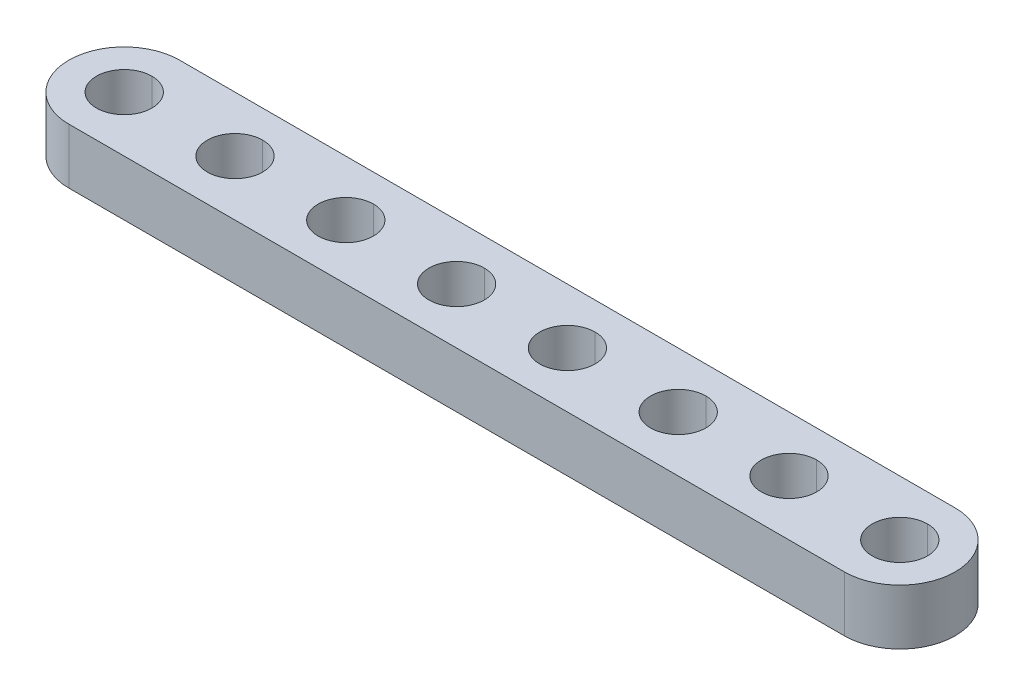
ISO-10303-21;
HEADER;
FILE_DESCRIPTION(('STEP AP214'),'2;1');
FILE_NAME('part.step','',(''),(''),'','','');
FILE_SCHEMA(('AUTOMOTIVE_DESIGN { 1 0 10303 214 1 1 1 1 }'));
ENDSEC;
DATA;
#1=APPLICATION_CONTEXT('core data for automotive mechanical design processes');
#2=APPLICATION_PROTOCOL_DEFINITION('international standard','automotive_design',2000,#1);
#3=PRODUCT_CONTEXT('',#1,'mechanical');
#4=PRODUCT('Part','Part','',(#3));
#5=PRODUCT_RELATED_PRODUCT_CATEGORY('part','',(#4));
#6=PRODUCT_DEFINITION_FORMATION('','',#4);
#7=PRODUCT_DEFINITION_CONTEXT('part definition',#1,'design');
#8=PRODUCT_DEFINITION('design','',#6,#7);
#9=PRODUCT_DEFINITION_SHAPE('','',#8);
#10=(LENGTH_UNIT() NAMED_UNIT(*) SI_UNIT(.MILLI.,.METRE.));
#11=(NAMED_UNIT(*) PLANE_ANGLE_UNIT() SI_UNIT($,.RADIAN.));
#12=(NAMED_UNIT(*) SI_UNIT($,.STERADIAN.) SOLID_ANGLE_UNIT());
#13=UNCERTAINTY_MEASURE_WITH_UNIT(LENGTH_MEASURE(1.E-05),#10,'distance_accuracy_value','');
#14=(GEOMETRIC_REPRESENTATION_CONTEXT(3) GLOBAL_UNCERTAINTY_ASSIGNED_CONTEXT((#13)) GLOBAL_UNIT_ASSIGNED_CONTEXT((#10,
#11,#12)) REPRESENTATION_CONTEXT('',''));
#15=CARTESIAN_POINT('',(0.,0.,0.));
#16=DIRECTION('',(0.,0.,1.));
#17=DIRECTION('',(1.,0.,0.));
#18=AXIS2_PLACEMENT_3D('',#15,#16,#17);
#19=CARTESIAN_POINT('',(28.,4.,0.));
#20=DIRECTION('',(0.,1.,0.));
#21=DIRECTION('',(0.,0.,1.));
#22=AXIS2_PLACEMENT_3D('',#19,#20,#21);
#23=CYLINDRICAL_SURFACE('',#22,2.);
#24=DIRECTION('',(0.,1.,0.));
#25=VECTOR('',#24,1.);
#26=CARTESIAN_POINT('',(28.,4.,-2.));
#27=LINE('',#26,#25);
#28=CARTESIAN_POINT('',(28.,0.,-2.));
#29=VERTEX_POINT('',#28);
#30=CARTESIAN_POINT('',(28.,4.,-2.));
#31=VERTEX_POINT('',#30);
#32=EDGE_CURVE('E224',#29,#31,#27,.T.);
#33=ORIENTED_EDGE('',*,*,#32,.F.);
#34=CARTESIAN_POINT('',(28.,0.,0.));
#35=DIRECTION('',(0.,1.,0.));
#36=DIRECTION('',(0.,0.,1.));
#37=AXIS2_PLACEMENT_3D('',#34,#35,#36);
#38=CIRCLE('',#37,2.);
#39=CARTESIAN_POINT('',(28.,0.,2.));
#40=VERTEX_POINT('',#39);
#41=EDGE_CURVE('E197',#40,#29,#38,.T.);
#42=ORIENTED_EDGE('',*,*,#41,.F.);
#43=DIRECTION('',(0.,1.,0.));
#44=VECTOR('',#43,1.);
#45=CARTESIAN_POINT('',(28.,4.,2.));
#46=LINE('',#45,#44);
#47=CARTESIAN_POINT('',(28.,4.,2.));
#48=VERTEX_POINT('',#47);
#49=EDGE_CURVE('E210',#40,#48,#46,.T.);
#50=ORIENTED_EDGE('',*,*,#49,.T.);
#51=CARTESIAN_POINT('',(28.,4.,0.));
#52=DIRECTION('',(0.,1.,0.));
#53=DIRECTION('',(0.,0.,1.));
#54=AXIS2_PLACEMENT_3D('',#51,#52,#53);
#55=CIRCLE('',#54,2.);
#56=EDGE_CURVE('E305',#48,#31,#55,.T.);
#57=ORIENTED_EDGE('',*,*,#56,.T.);
#58=EDGE_LOOP('',(#33,#42,#50,#57));
#59=FACE_BOUND('',#58,.T.);
#60=ADVANCED_FACE('F14',(#59),#23,.F.);
#61=CARTESIAN_POINT('',(20.,4.,0.));
#62=DIRECTION('',(0.,1.,0.));
#63=DIRECTION('',(0.,0.,1.));
#64=AXIS2_PLACEMENT_3D('',#61,#62,#63);
#65=CYLINDRICAL_SURFACE('',#64,2.);
#66=DIRECTION('',(0.,1.,0.));
#67=VECTOR('',#66,1.);
#68=CARTESIAN_POINT('',(20.,4.,-2.));
#69=LINE('',#68,#67);
#70=CARTESIAN_POINT('',(20.,0.,-2.));
#71=VERTEX_POINT('',#70);
#72=CARTESIAN_POINT('',(20.,4.,-2.));
#73=VERTEX_POINT('',#72);
#74=EDGE_CURVE('E191',#71,#73,#69,.T.);
#75=ORIENTED_EDGE('',*,*,#74,.F.);
#76=CARTESIAN_POINT('',(20.,0.,0.));
#77=DIRECTION('',(0.,1.,0.));
#78=DIRECTION('',(0.,0.,1.));
#79=AXIS2_PLACEMENT_3D('',#76,#77,#78);
#80=CIRCLE('',#79,2.);
#81=CARTESIAN_POINT('',(20.,0.,2.));
#82=VERTEX_POINT('',#81);
#83=EDGE_CURVE('E185',#82,#71,#80,.T.);
#84=ORIENTED_EDGE('',*,*,#83,.F.);
#85=DIRECTION('',(0.,1.,0.));
#86=VECTOR('',#85,1.);
#87=CARTESIAN_POINT('',(20.,4.,2.));
#88=LINE('',#87,#86);
#89=CARTESIAN_POINT('',(20.,4.,2.));
#90=VERTEX_POINT('',#89);
#91=EDGE_CURVE('E188',#82,#90,#88,.T.);
#92=ORIENTED_EDGE('',*,*,#91,.T.);
#93=CARTESIAN_POINT('',(20.,4.,0.));
#94=DIRECTION('',(0.,1.,0.));
#95=DIRECTION('',(0.,0.,1.));
#96=AXIS2_PLACEMENT_3D('',#93,#94,#95);
#97=CIRCLE('',#96,2.);
#98=EDGE_CURVE('E382',#90,#73,#97,.T.);
#99=ORIENTED_EDGE('',*,*,#98,.T.);
#100=EDGE_LOOP('',(#75,#84,#92,#99));
#101=FACE_BOUND('',#100,.T.);
#102=ADVANCED_FACE('F187',(#101),#65,.F.);
#103=CARTESIAN_POINT('',(12.,4.,0.));
#104=DIRECTION('',(0.,1.,0.));
#105=DIRECTION('',(0.,0.,1.));
#106=AXIS2_PLACEMENT_3D('',#103,#104,#105);
#107=CYLINDRICAL_SURFACE('',#106,2.);
#108=DIRECTION('',(0.,1.,0.));
#109=VECTOR('',#108,1.);
#110=CARTESIAN_POINT('',(12.,4.,-2.));
#111=LINE('',#110,#109);
#112=CARTESIAN_POINT('',(12.,0.,-2.));
#113=VERTEX_POINT('',#112);
#114=CARTESIAN_POINT('',(12.,4.,-2.));
#115=VERTEX_POINT('',#114);
#116=EDGE_CURVE('E379',#113,#115,#111,.T.);
#117=ORIENTED_EDGE('',*,*,#116,.F.);
#118=CARTESIAN_POINT('',(12.,0.,0.));
#119=DIRECTION('',(0.,1.,0.));
#120=DIRECTION('',(0.,0.,1.));
#121=AXIS2_PLACEMENT_3D('',#118,#119,#120);
#122=CIRCLE('',#121,2.);
#123=CARTESIAN_POINT('',(12.,0.,2.));
#124=VERTEX_POINT('',#123);
#125=EDGE_CURVE('E196',#124,#113,#122,.T.);
#126=ORIENTED_EDGE('',*,*,#125,.F.);
#127=DIRECTION('',(0.,1.,0.));
#128=VECTOR('',#127,1.);
#129=CARTESIAN_POINT('',(12.,4.,2.));
#130=LINE('',#129,#128);
#131=CARTESIAN_POINT('',(12.,4.,2.));
#132=VERTEX_POINT('',#131);
#133=EDGE_CURVE('E236',#124,#132,#130,.T.);
#134=ORIENTED_EDGE('',*,*,#133,.T.);
#135=CARTESIAN_POINT('',(12.,4.,0.));
#136=DIRECTION('',(0.,1.,0.));
#137=DIRECTION('',(0.,0.,1.));
#138=AXIS2_PLACEMENT_3D('',#135,#136,#137);
#139=CIRCLE('',#138,2.);
#140=EDGE_CURVE('E380',#132,#115,#139,.T.);
#141=ORIENTED_EDGE('',*,*,#140,.T.);
#142=EDGE_LOOP('',(#117,#126,#134,#141));
#143=FACE_BOUND('',#142,.T.);
#144=ADVANCED_FACE('F480',(#143),#107,.F.);
#145=CARTESIAN_POINT('',(4.,4.,0.));
#146=DIRECTION('',(0.,1.,0.));
#147=DIRECTION('',(0.,0.,1.));
#148=AXIS2_PLACEMENT_3D('',#145,#146,#147);
#149=CYLINDRICAL_SURFACE('',#148,2.);
#150=DIRECTION('',(0.,1.,0.));
#151=VECTOR('',#150,1.);
#152=CARTESIAN_POINT('',(4.,4.,-2.));
#153=LINE('',#152,#151);
#154=CARTESIAN_POINT('',(4.,0.,-2.));
#155=VERTEX_POINT('',#154);
#156=CARTESIAN_POINT('',(4.,4.,-2.));
#157=VERTEX_POINT('',#156);
#158=EDGE_CURVE('E235',#155,#157,#153,.T.);
#159=ORIENTED_EDGE('',*,*,#158,.F.);
#160=CARTESIAN_POINT('',(4.,0.,0.));
#161=DIRECTION('',(0.,1.,0.));
#162=DIRECTION('',(0.,0.,1.));
#163=AXIS2_PLACEMENT_3D('',#160,#161,#162);
#164=CIRCLE('',#163,2.);
#165=CARTESIAN_POINT('',(4.,0.,2.));
#166=VERTEX_POINT('',#165);
#167=EDGE_CURVE('E290',#166,#155,#164,.T.);
#168=ORIENTED_EDGE('',*,*,#167,.F.);
#169=DIRECTION('',(0.,1.,0.));
#170=VECTOR('',#169,1.);
#171=CARTESIAN_POINT('',(4.,4.,2.));
#172=LINE('',#171,#170);
#173=CARTESIAN_POINT('',(4.,4.,2.));
#174=VERTEX_POINT('',#173);
#175=EDGE_CURVE('E384',#166,#174,#172,.T.);
#176=ORIENTED_EDGE('',*,*,#175,.T.);
#177=CARTESIAN_POINT('',(4.,4.,0.));
#178=DIRECTION('',(0.,1.,0.));
#179=DIRECTION('',(0.,0.,1.));
#180=AXIS2_PLACEMENT_3D('',#177,#178,#179);
#181=CIRCLE('',#180,2.);
#182=EDGE_CURVE('E261',#174,#157,#181,.T.);
#183=ORIENTED_EDGE('',*,*,#182,.T.);
#184=EDGE_LOOP('',(#159,#168,#176,#183));
#185=FACE_BOUND('',#184,.T.);
#186=ADVANCED_FACE('F518',(#185),#149,.F.);
#187=CARTESIAN_POINT('',(-4.,4.,0.));
#188=DIRECTION('',(0.,1.,0.));
#189=DIRECTION('',(0.,0.,1.));
#190=AXIS2_PLACEMENT_3D('',#187,#188,#189);
#191=CYLINDRICAL_SURFACE('',#190,2.);
#192=DIRECTION('',(0.,1.,0.));
#193=VECTOR('',#192,1.);
#194=CARTESIAN_POINT('',(-4.,4.,-2.));
#195=LINE('',#194,#193);
#196=CARTESIAN_POINT('',(-4.,0.,-2.));
#197=VERTEX_POINT('',#196);
#198=CARTESIAN_POINT('',(-4.,4.,-2.));
#199=VERTEX_POINT('',#198);
#200=EDGE_CURVE('E279',#197,#199,#195,.T.);
#201=ORIENTED_EDGE('',*,*,#200,.F.);
#202=CARTESIAN_POINT('',(-4.,0.,0.));
#203=DIRECTION('',(0.,1.,0.));
#204=DIRECTION('',(0.,0.,1.));
#205=AXIS2_PLACEMENT_3D('',#202,#203,#204);
#206=CIRCLE('',#205,2.);
#207=CARTESIAN_POINT('',(-4.,0.,2.));
#208=VERTEX_POINT('',#207);
#209=EDGE_CURVE('E350',#208,#197,#206,.T.);
#210=ORIENTED_EDGE('',*,*,#209,.F.);
#211=DIRECTION('',(0.,1.,0.));
#212=VECTOR('',#211,1.);
#213=CARTESIAN_POINT('',(-4.,4.,2.));
#214=LINE('',#213,#212);
#215=CARTESIAN_POINT('',(-4.,4.,2.));
#216=VERTEX_POINT('',#215);
#217=EDGE_CURVE('E245',#208,#216,#214,.T.);
#218=ORIENTED_EDGE('',*,*,#217,.T.);
#219=CARTESIAN_POINT('',(-4.,4.,0.));
#220=DIRECTION('',(0.,1.,0.));
#221=DIRECTION('',(0.,0.,1.));
#222=AXIS2_PLACEMENT_3D('',#219,#220,#221);
#223=CIRCLE('',#222,2.);
#224=EDGE_CURVE('E258',#216,#199,#223,.T.);
#225=ORIENTED_EDGE('',*,*,#224,.T.);
#226=EDGE_LOOP('',(#201,#210,#218,#225));
#227=FACE_BOUND('',#226,.T.);
#228=ADVANCED_FACE('F516',(#227),#191,.F.);
#229=CARTESIAN_POINT('',(-12.,4.,0.));
#230=DIRECTION('',(0.,1.,0.));
#231=DIRECTION('',(0.,0.,1.));
#232=AXIS2_PLACEMENT_3D('',#229,#230,#231);
#233=CYLINDRICAL_SURFACE('',#232,2.);
#234=DIRECTION('',(0.,1.,0.));
#235=VECTOR('',#234,1.);
#236=CARTESIAN_POINT('',(-12.,4.,-2.));
#237=LINE('',#236,#235);
#238=CARTESIAN_POINT('',(-12.,0.,-2.));
#239=VERTEX_POINT('',#238);
#240=CARTESIAN_POINT('',(-12.,4.,-2.));
#241=VERTEX_POINT('',#240);
#242=EDGE_CURVE('E244',#239,#241,#237,.T.);
#243=ORIENTED_EDGE('',*,*,#242,.F.);
#244=CARTESIAN_POINT('',(-12.,0.,0.));
#245=DIRECTION('',(0.,1.,0.));
#246=DIRECTION('',(0.,0.,1.));
#247=AXIS2_PLACEMENT_3D('',#244,#245,#246);
#248=CIRCLE('',#247,2.);
#249=CARTESIAN_POINT('',(-12.,0.,2.));
#250=VERTEX_POINT('',#249);
#251=EDGE_CURVE('E239',#250,#239,#248,.T.);
#252=ORIENTED_EDGE('',*,*,#251,.F.);
#253=DIRECTION('',(0.,1.,0.));
#254=VECTOR('',#253,1.);
#255=CARTESIAN_POINT('',(-12.,4.,2.));
#256=LINE('',#255,#254);
#257=CARTESIAN_POINT('',(-12.,4.,2.));
#258=VERTEX_POINT('',#257);
#259=EDGE_CURVE('E263',#250,#258,#256,.T.);
#260=ORIENTED_EDGE('',*,*,#259,.T.);
#261=CARTESIAN_POINT('',(-12.,4.,0.));
#262=DIRECTION('',(0.,1.,0.));
#263=DIRECTION('',(0.,0.,1.));
#264=AXIS2_PLACEMENT_3D('',#261,#262,#263);
#265=CIRCLE('',#264,2.);
#266=EDGE_CURVE('E260',#258,#241,#265,.T.);
#267=ORIENTED_EDGE('',*,*,#266,.T.);
#268=EDGE_LOOP('',(#243,#252,#260,#267));
#269=FACE_BOUND('',#268,.T.);
#270=ADVANCED_FACE('F515',(#269),#233,.F.);
#271=CARTESIAN_POINT('',(-20.,4.,0.));
#272=DIRECTION('',(0.,1.,0.));
#273=DIRECTION('',(0.,0.,1.));
#274=AXIS2_PLACEMENT_3D('',#271,#272,#273);
#275=CYLINDRICAL_SURFACE('',#274,2.);
#276=DIRECTION('',(0.,1.,0.));
#277=VECTOR('',#276,1.);
#278=CARTESIAN_POINT('',(-20.,4.,-2.));
#279=LINE('',#278,#277);
#280=CARTESIAN_POINT('',(-20.,0.,-2.));
#281=VERTEX_POINT('',#280);
#282=CARTESIAN_POINT('',(-20.,4.,-2.));
#283=VERTEX_POINT('',#282);
#284=EDGE_CURVE('E226',#281,#283,#279,.T.);
#285=ORIENTED_EDGE('',*,*,#284,.F.);
#286=CARTESIAN_POINT('',(-20.,0.,0.));
#287=DIRECTION('',(0.,1.,0.));
#288=DIRECTION('',(0.,0.,1.));
#289=AXIS2_PLACEMENT_3D('',#286,#287,#288);
#290=CIRCLE('',#289,2.);
#291=CARTESIAN_POINT('',(-20.,0.,2.));
#292=VERTEX_POINT('',#291);
#293=EDGE_CURVE('E25',#292,#281,#290,.T.);
#294=ORIENTED_EDGE('',*,*,#293,.F.);
#295=DIRECTION('',(0.,1.,0.));
#296=VECTOR('',#295,1.);
#297=CARTESIAN_POINT('',(-20.,4.,2.));
#298=LINE('',#297,#296);
#299=CARTESIAN_POINT('',(-20.,4.,2.));
#300=VERTEX_POINT('',#299);
#301=EDGE_CURVE('E294',#292,#300,#298,.T.);
#302=ORIENTED_EDGE('',*,*,#301,.T.);
#303=CARTESIAN_POINT('',(-20.,4.,0.));
#304=DIRECTION('',(0.,1.,0.));
#305=DIRECTION('',(0.,0.,1.));
#306=AXIS2_PLACEMENT_3D('',#303,#304,#305);
#307=CIRCLE('',#306,2.);
#308=EDGE_CURVE('E298',#300,#283,#307,.T.);
#309=ORIENTED_EDGE('',*,*,#308,.T.);
#310=EDGE_LOOP('',(#285,#294,#302,#309));
#311=FACE_BOUND('',#310,.T.);
#312=ADVANCED_FACE('F462',(#311),#275,.F.);
#313=CARTESIAN_POINT('',(-28.,4.,0.));
#314=DIRECTION('',(0.,1.,0.));
#315=DIRECTION('',(0.,0.,1.));
#316=AXIS2_PLACEMENT_3D('',#313,#314,#315);
#317=CYLINDRICAL_SURFACE('',#316,2.);
#318=DIRECTION('',(0.,1.,0.));
#319=VECTOR('',#318,1.);
#320=CARTESIAN_POINT('',(-28.,4.,-2.));
#321=LINE('',#320,#319);
#322=CARTESIAN_POINT('',(-28.,0.,-2.));
#323=VERTEX_POINT('',#322);
#324=CARTESIAN_POINT('',(-28.,4.,-2.));
#325=VERTEX_POINT('',#324);
#326=EDGE_CURVE('E246',#323,#325,#321,.T.);
#327=ORIENTED_EDGE('',*,*,#326,.F.);
#328=CARTESIAN_POINT('',(-28.,0.,0.));
#329=DIRECTION('',(0.,1.,0.));
#330=DIRECTION('',(0.,0.,1.));
#331=AXIS2_PLACEMENT_3D('',#328,#329,#330);
#332=CIRCLE('',#331,2.);
#333=CARTESIAN_POINT('',(-28.,0.,2.));
#334=VERTEX_POINT('',#333);
#335=EDGE_CURVE('E9',#334,#323,#332,.T.);
#336=ORIENTED_EDGE('',*,*,#335,.F.);
#337=DIRECTION('',(0.,1.,0.));
#338=VECTOR('',#337,1.);
#339=CARTESIAN_POINT('',(-28.,4.,2.));
#340=LINE('',#339,#338);
#341=CARTESIAN_POINT('',(-28.,4.,2.));
#342=VERTEX_POINT('',#341);
#343=EDGE_CURVE('E301',#334,#342,#340,.T.);
#344=ORIENTED_EDGE('',*,*,#343,.T.);
#345=CARTESIAN_POINT('',(-28.,4.,0.));
#346=DIRECTION('',(0.,1.,0.));
#347=DIRECTION('',(0.,0.,1.));
#348=AXIS2_PLACEMENT_3D('',#345,#346,#347);
#349=CIRCLE('',#348,2.);
#350=EDGE_CURVE('E295',#342,#325,#349,.T.);
#351=ORIENTED_EDGE('',*,*,#350,.T.);
#352=EDGE_LOOP('',(#327,#336,#344,#351));
#353=FACE_BOUND('',#352,.T.);
#354=ADVANCED_FACE('F470',(#353),#317,.F.);
#355=CARTESIAN_POINT('',(-28.,0.,0.));
#356=DIRECTION('',(0.,1.,0.));
#357=DIRECTION('',(1.,0.,0.));
#358=AXIS2_PLACEMENT_3D('',#355,#356,#357);
#359=PLANE('',#358);
#360=ORIENTED_EDGE('',*,*,#335,.T.);
#361=CARTESIAN_POINT('',(-28.,0.,0.));
#362=DIRECTION('',(0.,1.,0.));
#363=DIRECTION('',(0.,0.,1.));
#364=AXIS2_PLACEMENT_3D('',#361,#362,#363);
#365=CIRCLE('',#364,2.);
#366=EDGE_CURVE('E251',#323,#334,#365,.T.);
#367=ORIENTED_EDGE('',*,*,#366,.T.);
#368=EDGE_LOOP('',(#360,#367));
#369=FACE_BOUND('',#368,.T.);
#370=ORIENTED_EDGE('',*,*,#293,.T.);
#371=CARTESIAN_POINT('',(-20.,0.,0.));
#372=DIRECTION('',(0.,1.,0.));
#373=DIRECTION('',(0.,0.,1.));
#374=AXIS2_PLACEMENT_3D('',#371,#372,#373);
#375=CIRCLE('',#374,2.);
#376=EDGE_CURVE('E230',#281,#292,#375,.T.);
#377=ORIENTED_EDGE('',*,*,#376,.T.);
#378=EDGE_LOOP('',(#370,#377));
#379=FACE_BOUND('',#378,.T.);
#380=ORIENTED_EDGE('',*,*,#251,.T.);
#381=CARTESIAN_POINT('',(-12.,0.,0.));
#382=DIRECTION('',(0.,1.,0.));
#383=DIRECTION('',(0.,0.,1.));
#384=AXIS2_PLACEMENT_3D('',#381,#382,#383);
#385=CIRCLE('',#384,2.);
#386=EDGE_CURVE('E240',#239,#250,#385,.T.);
#387=ORIENTED_EDGE('',*,*,#386,.T.);
#388=EDGE_LOOP('',(#380,#387));
#389=FACE_BOUND('',#388,.T.);
#390=ORIENTED_EDGE('',*,*,#209,.T.);
#391=CARTESIAN_POINT('',(-4.,0.,0.));
#392=DIRECTION('',(0.,1.,0.));
#393=DIRECTION('',(0.,0.,1.));
#394=AXIS2_PLACEMENT_3D('',#391,#392,#393);
#395=CIRCLE('',#394,2.);
#396=EDGE_CURVE('E388',#197,#208,#395,.T.);
#397=ORIENTED_EDGE('',*,*,#396,.T.);
#398=EDGE_LOOP('',(#390,#397));
#399=FACE_BOUND('',#398,.T.);
#400=ORIENTED_EDGE('',*,*,#167,.T.);
#401=CARTESIAN_POINT('',(4.,0.,0.));
#402=DIRECTION('',(0.,1.,0.));
#403=DIRECTION('',(0.,0.,1.));
#404=AXIS2_PLACEMENT_3D('',#401,#402,#403);
#405=CIRCLE('',#404,2.);
#406=EDGE_CURVE('E231',#155,#166,#405,.T.);
#407=ORIENTED_EDGE('',*,*,#406,.T.);
#408=EDGE_LOOP('',(#400,#407));
#409=FACE_BOUND('',#408,.T.);
#410=ORIENTED_EDGE('',*,*,#125,.T.);
#411=CARTESIAN_POINT('',(12.,0.,0.));
#412=DIRECTION('',(0.,1.,0.));
#413=DIRECTION('',(0.,0.,1.));
#414=AXIS2_PLACEMENT_3D('',#411,#412,#413);
#415=CIRCLE('',#414,2.);
#416=EDGE_CURVE('E205',#113,#124,#415,.T.);
#417=ORIENTED_EDGE('',*,*,#416,.T.);
#418=EDGE_LOOP('',(#410,#417));
#419=FACE_BOUND('',#418,.T.);
#420=ORIENTED_EDGE('',*,*,#83,.T.);
#421=CARTESIAN_POINT('',(20.,0.,0.));
#422=DIRECTION('',(0.,1.,0.));
#423=DIRECTION('',(0.,0.,1.));
#424=AXIS2_PLACEMENT_3D('',#421,#422,#423);
#425=CIRCLE('',#424,2.);
#426=EDGE_CURVE('E201',#71,#82,#425,.T.);
#427=ORIENTED_EDGE('',*,*,#426,.T.);
#428=EDGE_LOOP('',(#420,#427));
#429=FACE_BOUND('',#428,.T.);
#430=ORIENTED_EDGE('',*,*,#41,.T.);
#431=CARTESIAN_POINT('',(28.,0.,0.));
#432=DIRECTION('',(0.,1.,0.));
#433=DIRECTION('',(0.,0.,1.));
#434=AXIS2_PLACEMENT_3D('',#431,#432,#433);
#435=CIRCLE('',#434,2.);
#436=EDGE_CURVE('E405',#29,#40,#435,.T.);
#437=ORIENTED_EDGE('',*,*,#436,.T.);
#438=EDGE_LOOP('',(#430,#437));
#439=FACE_BOUND('',#438,.T.);
#440=CARTESIAN_POINT('',(-28.,0.,0.));
#441=DIRECTION('',(0.,1.,0.));
#442=DIRECTION('',(0.,0.,1.));
#443=AXIS2_PLACEMENT_3D('',#440,#441,#442);
#444=CIRCLE('',#443,4.);
#445=CARTESIAN_POINT('',(-28.,0.,-4.));
#446=VERTEX_POINT('',#445);
#447=CARTESIAN_POINT('',(-28.,0.,4.));
#448=VERTEX_POINT('',#447);
#449=EDGE_CURVE('E314',#446,#448,#444,.T.);
#450=ORIENTED_EDGE('',*,*,#449,.F.);
#451=DIRECTION('',(-1.,0.,0.));
#452=VECTOR('',#451,1.);
#453=CARTESIAN_POINT('',(-28.,0.,-4.));
#454=LINE('',#453,#452);
#455=CARTESIAN_POINT('',(28.,0.,-4.));
#456=VERTEX_POINT('',#455);
#457=EDGE_CURVE('E306',#456,#446,#454,.T.);
#458=ORIENTED_EDGE('',*,*,#457,.F.);
#459=CARTESIAN_POINT('',(28.,0.,0.));
#460=DIRECTION('',(0.,1.,0.));
#461=DIRECTION('',(0.,0.,1.));
#462=AXIS2_PLACEMENT_3D('',#459,#460,#461);
#463=CIRCLE('',#462,4.);
#464=CARTESIAN_POINT('',(28.,0.,4.));
#465=VERTEX_POINT('',#464);
#466=EDGE_CURVE('E283',#465,#456,#463,.T.);
#467=ORIENTED_EDGE('',*,*,#466,.F.);
#468=DIRECTION('',(1.,0.,0.));
#469=VECTOR('',#468,1.);
#470=CARTESIAN_POINT('',(-28.,0.,4.));
#471=LINE('',#470,#469);
#472=EDGE_CURVE('E257',#448,#465,#471,.T.);
#473=ORIENTED_EDGE('',*,*,#472,.F.);
#474=EDGE_LOOP('',(#450,#458,#467,#473));
#475=FACE_BOUND('',#474,.T.);
#476=ADVANCED_FACE('F207',(#369,#379,#389,#399,#409,#419,#429,#439,#475),#359,.F.);
#477=CARTESIAN_POINT('',(-28.,4.,0.));
#478=DIRECTION('',(0.,1.,0.));
#479=DIRECTION('',(1.,0.,0.));
#480=AXIS2_PLACEMENT_3D('',#477,#478,#479);
#481=PLANE('',#480);
#482=ORIENTED_EDGE('',*,*,#350,.F.);
#483=CARTESIAN_POINT('',(-28.,4.,0.));
#484=DIRECTION('',(0.,1.,0.));
#485=DIRECTION('',(0.,0.,1.));
#486=AXIS2_PLACEMENT_3D('',#483,#484,#485);
#487=CIRCLE('',#486,2.);
#488=EDGE_CURVE('E250',#325,#342,#487,.T.);
#489=ORIENTED_EDGE('',*,*,#488,.F.);
#490=EDGE_LOOP('',(#482,#489));
#491=FACE_BOUND('',#490,.T.);
#492=ORIENTED_EDGE('',*,*,#308,.F.);
#493=CARTESIAN_POINT('',(-20.,4.,0.));
#494=DIRECTION('',(0.,1.,0.));
#495=DIRECTION('',(0.,0.,1.));
#496=AXIS2_PLACEMENT_3D('',#493,#494,#495);
#497=CIRCLE('',#496,2.);
#498=EDGE_CURVE('E229',#283,#300,#497,.T.);
#499=ORIENTED_EDGE('',*,*,#498,.F.);
#500=EDGE_LOOP('',(#492,#499));
#501=FACE_BOUND('',#500,.T.);
#502=ORIENTED_EDGE('',*,*,#266,.F.);
#503=CARTESIAN_POINT('',(-12.,4.,0.));
#504=DIRECTION('',(0.,1.,0.));
#505=DIRECTION('',(0.,0.,1.));
#506=AXIS2_PLACEMENT_3D('',#503,#504,#505);
#507=CIRCLE('',#506,2.);
#508=EDGE_CURVE('E267',#241,#258,#507,.T.);
#509=ORIENTED_EDGE('',*,*,#508,.F.);
#510=EDGE_LOOP('',(#502,#509));
#511=FACE_BOUND('',#510,.T.);
#512=ORIENTED_EDGE('',*,*,#224,.F.);
#513=CARTESIAN_POINT('',(-4.,4.,0.));
#514=DIRECTION('',(0.,1.,0.));
#515=DIRECTION('',(0.,0.,1.));
#516=AXIS2_PLACEMENT_3D('',#513,#514,#515);
#517=CIRCLE('',#516,2.);
#518=EDGE_CURVE('E275',#199,#216,#517,.T.);
#519=ORIENTED_EDGE('',*,*,#518,.F.);
#520=EDGE_LOOP('',(#512,#519));
#521=FACE_BOUND('',#520,.T.);
#522=ORIENTED_EDGE('',*,*,#182,.F.);
#523=CARTESIAN_POINT('',(4.,4.,0.));
#524=DIRECTION('',(0.,1.,0.));
#525=DIRECTION('',(0.,0.,1.));
#526=AXIS2_PLACEMENT_3D('',#523,#524,#525);
#527=CIRCLE('',#526,2.);
#528=EDGE_CURVE('E368',#157,#174,#527,.T.);
#529=ORIENTED_EDGE('',*,*,#528,.F.);
#530=EDGE_LOOP('',(#522,#529));
#531=FACE_BOUND('',#530,.T.);
#532=ORIENTED_EDGE('',*,*,#140,.F.);
#533=CARTESIAN_POINT('',(12.,4.,0.));
#534=DIRECTION('',(0.,1.,0.));
#535=DIRECTION('',(0.,0.,1.));
#536=AXIS2_PLACEMENT_3D('',#533,#534,#535);
#537=CIRCLE('',#536,2.);
#538=EDGE_CURVE('E372',#115,#132,#537,.T.);
#539=ORIENTED_EDGE('',*,*,#538,.F.);
#540=EDGE_LOOP('',(#532,#539));
#541=FACE_BOUND('',#540,.T.);
#542=ORIENTED_EDGE('',*,*,#98,.F.);
#543=CARTESIAN_POINT('',(20.,4.,0.));
#544=DIRECTION('',(0.,1.,0.));
#545=DIRECTION('',(0.,0.,1.));
#546=AXIS2_PLACEMENT_3D('',#543,#544,#545);
#547=CIRCLE('',#546,2.);
#548=EDGE_CURVE('E203',#73,#90,#547,.T.);
#549=ORIENTED_EDGE('',*,*,#548,.F.);
#550=EDGE_LOOP('',(#542,#549));
#551=FACE_BOUND('',#550,.T.);
#552=ORIENTED_EDGE('',*,*,#56,.F.);
#553=CARTESIAN_POINT('',(28.,4.,0.));
#554=DIRECTION('',(0.,1.,0.));
#555=DIRECTION('',(0.,0.,1.));
#556=AXIS2_PLACEMENT_3D('',#553,#554,#555);
#557=CIRCLE('',#556,2.);
#558=EDGE_CURVE('E220',#31,#48,#557,.T.);
#559=ORIENTED_EDGE('',*,*,#558,.F.);
#560=EDGE_LOOP('',(#552,#559));
#561=FACE_BOUND('',#560,.T.);
#562=CARTESIAN_POINT('',(-28.,4.,0.));
#563=DIRECTION('',(0.,1.,0.));
#564=DIRECTION('',(0.,0.,1.));
#565=AXIS2_PLACEMENT_3D('',#562,#563,#564);
#566=CIRCLE('',#565,4.);
#567=CARTESIAN_POINT('',(-28.,4.,-4.));
#568=VERTEX_POINT('',#567);
#569=CARTESIAN_POINT('',(-28.,4.,4.));
#570=VERTEX_POINT('',#569);
#571=EDGE_CURVE('E272',#568,#570,#566,.T.);
#572=ORIENTED_EDGE('',*,*,#571,.T.);
#573=DIRECTION('',(1.,0.,0.));
#574=VECTOR('',#573,1.);
#575=CARTESIAN_POINT('',(-28.,4.,4.));
#576=LINE('',#575,#574);
#577=CARTESIAN_POINT('',(28.,4.,4.));
#578=VERTEX_POINT('',#577);
#579=EDGE_CURVE('E256',#570,#578,#576,.T.);
#580=ORIENTED_EDGE('',*,*,#579,.T.);
#581=CARTESIAN_POINT('',(28.,4.,0.));
#582=DIRECTION('',(0.,1.,0.));
#583=DIRECTION('',(0.,0.,1.));
#584=AXIS2_PLACEMENT_3D('',#581,#582,#583);
#585=CIRCLE('',#584,4.);
#586=CARTESIAN_POINT('',(28.,4.,-4.));
#587=VERTEX_POINT('',#586);
#588=EDGE_CURVE('E18',#578,#587,#585,.T.);
#589=ORIENTED_EDGE('',*,*,#588,.T.);
#590=DIRECTION('',(-1.,0.,0.));
#591=VECTOR('',#590,1.);
#592=CARTESIAN_POINT('',(-28.,4.,-4.));
#593=LINE('',#592,#591);
#594=EDGE_CURVE('E40',#587,#568,#593,.T.);
#595=ORIENTED_EDGE('',*,*,#594,.T.);
#596=EDGE_LOOP('',(#572,#580,#589,#595));
#597=FACE_BOUND('',#596,.T.);
#598=ADVANCED_FACE('F424',(#491,#501,#511,#521,#531,#541,#551,#561,#597),#481,.T.);
#599=CARTESIAN_POINT('',(-28.,4.,-4.));
#600=DIRECTION('',(0.,0.,1.));
#601=DIRECTION('',(1.,0.,0.));
#602=AXIS2_PLACEMENT_3D('',#599,#600,#601);
#603=PLANE('',#602);
#604=ORIENTED_EDGE('',*,*,#457,.T.);
#605=DIRECTION('',(0.,-1.,0.));
#606=VECTOR('',#605,1.);
#607=CARTESIAN_POINT('',(-28.,4.,-4.));
#608=LINE('',#607,#606);
#609=EDGE_CURVE('E268',#568,#446,#608,.T.);
#610=ORIENTED_EDGE('',*,*,#609,.F.);
#611=ORIENTED_EDGE('',*,*,#594,.F.);
#612=DIRECTION('',(0.,-1.,0.));
#613=VECTOR('',#612,1.);
#614=CARTESIAN_POINT('',(28.,4.,-4.));
#615=LINE('',#614,#613);
#616=EDGE_CURVE('E280',#587,#456,#615,.T.);
#617=ORIENTED_EDGE('',*,*,#616,.T.);
#618=EDGE_LOOP('',(#604,#610,#611,#617));
#619=FACE_BOUND('',#618,.T.);
#620=ADVANCED_FACE('F427',(#619),#603,.F.);
#621=CARTESIAN_POINT('',(28.,4.,0.));
#622=DIRECTION('',(0.,-1.,0.));
#623=DIRECTION('',(0.,0.,-1.));
#624=AXIS2_PLACEMENT_3D('',#621,#622,#623);
#625=CYLINDRICAL_SURFACE('',#624,4.);
#626=ORIENTED_EDGE('',*,*,#466,.T.);
#627=ORIENTED_EDGE('',*,*,#616,.F.);
#628=ORIENTED_EDGE('',*,*,#588,.F.);
#629=DIRECTION('',(0.,-1.,0.));
#630=VECTOR('',#629,1.);
#631=CARTESIAN_POINT('',(28.,4.,4.));
#632=LINE('',#631,#630);
#633=EDGE_CURVE('E252',#578,#465,#632,.T.);
#634=ORIENTED_EDGE('',*,*,#633,.T.);
#635=EDGE_LOOP('',(#626,#627,#628,#634));
#636=FACE_BOUND('',#635,.T.);
#637=ADVANCED_FACE('F16',(#636),#625,.T.);
#638=CARTESIAN_POINT('',(-28.,4.,4.));
#639=DIRECTION('',(0.,0.,-1.));
#640=DIRECTION('',(0.,-1.,0.));
#641=AXIS2_PLACEMENT_3D('',#638,#639,#640);
#642=PLANE('',#641);
#643=ORIENTED_EDGE('',*,*,#472,.T.);
#644=ORIENTED_EDGE('',*,*,#633,.F.);
#645=ORIENTED_EDGE('',*,*,#579,.F.);
#646=DIRECTION('',(0.,-1.,0.));
#647=VECTOR('',#646,1.);
#648=CARTESIAN_POINT('',(-28.,4.,4.));
#649=LINE('',#648,#647);
#650=EDGE_CURVE('E310',#570,#448,#649,.T.);
#651=ORIENTED_EDGE('',*,*,#650,.T.);
#652=EDGE_LOOP('',(#643,#644,#645,#651));
#653=FACE_BOUND('',#652,.T.);
#654=ADVANCED_FACE('F437',(#653),#642,.F.);
#655=CARTESIAN_POINT('',(-28.,4.,0.));
#656=DIRECTION('',(0.,-1.,0.));
#657=DIRECTION('',(0.,0.,-1.));
#658=AXIS2_PLACEMENT_3D('',#655,#656,#657);
#659=CYLINDRICAL_SURFACE('',#658,4.);
#660=ORIENTED_EDGE('',*,*,#449,.T.);
#661=ORIENTED_EDGE('',*,*,#650,.F.);
#662=ORIENTED_EDGE('',*,*,#571,.F.);
#663=ORIENTED_EDGE('',*,*,#609,.T.);
#664=EDGE_LOOP('',(#660,#661,#662,#663));
#665=FACE_BOUND('',#664,.T.);
#666=ADVANCED_FACE('F434',(#665),#659,.T.);
#667=CARTESIAN_POINT('',(-28.,4.,0.));
#668=DIRECTION('',(0.,1.,0.));
#669=DIRECTION('',(0.,0.,1.));
#670=AXIS2_PLACEMENT_3D('',#667,#668,#669);
#671=CYLINDRICAL_SURFACE('',#670,2.);
#672=ORIENTED_EDGE('',*,*,#366,.F.);
#673=ORIENTED_EDGE('',*,*,#326,.T.);
#674=ORIENTED_EDGE('',*,*,#488,.T.);
#675=ORIENTED_EDGE('',*,*,#343,.F.);
#676=EDGE_LOOP('',(#672,#673,#674,#675));
#677=FACE_BOUND('',#676,.T.);
#678=ADVANCED_FACE('F512',(#677),#671,.F.);
#679=CARTESIAN_POINT('',(-20.,4.,0.));
#680=DIRECTION('',(0.,1.,0.));
#681=DIRECTION('',(0.,0.,1.));
#682=AXIS2_PLACEMENT_3D('',#679,#680,#681);
#683=CYLINDRICAL_SURFACE('',#682,2.);
#684=ORIENTED_EDGE('',*,*,#376,.F.);
#685=ORIENTED_EDGE('',*,*,#284,.T.);
#686=ORIENTED_EDGE('',*,*,#498,.T.);
#687=ORIENTED_EDGE('',*,*,#301,.F.);
#688=EDGE_LOOP('',(#684,#685,#686,#687));
#689=FACE_BOUND('',#688,.T.);
#690=ADVANCED_FACE('F466',(#689),#683,.F.);
#691=CARTESIAN_POINT('',(-12.,4.,0.));
#692=DIRECTION('',(0.,1.,0.));
#693=DIRECTION('',(0.,0.,1.));
#694=AXIS2_PLACEMENT_3D('',#691,#692,#693);
#695=CYLINDRICAL_SURFACE('',#694,2.);
#696=ORIENTED_EDGE('',*,*,#386,.F.);
#697=ORIENTED_EDGE('',*,*,#242,.T.);
#698=ORIENTED_EDGE('',*,*,#508,.T.);
#699=ORIENTED_EDGE('',*,*,#259,.F.);
#700=EDGE_LOOP('',(#696,#697,#698,#699));
#701=FACE_BOUND('',#700,.T.);
#702=ADVANCED_FACE('F734',(#701),#695,.F.);
#703=CARTESIAN_POINT('',(-4.,4.,0.));
#704=DIRECTION('',(0.,1.,0.));
#705=DIRECTION('',(0.,0.,1.));
#706=AXIS2_PLACEMENT_3D('',#703,#704,#705);
#707=CYLINDRICAL_SURFACE('',#706,2.);
#708=ORIENTED_EDGE('',*,*,#396,.F.);
#709=ORIENTED_EDGE('',*,*,#200,.T.);
#710=ORIENTED_EDGE('',*,*,#518,.T.);
#711=ORIENTED_EDGE('',*,*,#217,.F.);
#712=EDGE_LOOP('',(#708,#709,#710,#711));
#713=FACE_BOUND('',#712,.T.);
#714=ADVANCED_FACE('F495',(#713),#707,.F.);
#715=CARTESIAN_POINT('',(4.,4.,0.));
#716=DIRECTION('',(0.,1.,0.));
#717=DIRECTION('',(0.,0.,1.));
#718=AXIS2_PLACEMENT_3D('',#715,#716,#717);
#719=CYLINDRICAL_SURFACE('',#718,2.);
#720=ORIENTED_EDGE('',*,*,#406,.F.);
#721=ORIENTED_EDGE('',*,*,#158,.T.);
#722=ORIENTED_EDGE('',*,*,#528,.T.);
#723=ORIENTED_EDGE('',*,*,#175,.F.);
#724=EDGE_LOOP('',(#720,#721,#722,#723));
#725=FACE_BOUND('',#724,.T.);
#726=ADVANCED_FACE('F487',(#725),#719,.F.);
#727=CARTESIAN_POINT('',(12.,4.,0.));
#728=DIRECTION('',(0.,1.,0.));
#729=DIRECTION('',(0.,0.,1.));
#730=AXIS2_PLACEMENT_3D('',#727,#728,#729);
#731=CYLINDRICAL_SURFACE('',#730,2.);
#732=ORIENTED_EDGE('',*,*,#416,.F.);
#733=ORIENTED_EDGE('',*,*,#116,.T.);
#734=ORIENTED_EDGE('',*,*,#538,.T.);
#735=ORIENTED_EDGE('',*,*,#133,.F.);
#736=EDGE_LOOP('',(#732,#733,#734,#735));
#737=FACE_BOUND('',#736,.T.);
#738=ADVANCED_FACE('F483',(#737),#731,.F.);
#739=CARTESIAN_POINT('',(20.,4.,0.));
#740=DIRECTION('',(0.,1.,0.));
#741=DIRECTION('',(0.,0.,1.));
#742=AXIS2_PLACEMENT_3D('',#739,#740,#741);
#743=CYLINDRICAL_SURFACE('',#742,2.);
#744=ORIENTED_EDGE('',*,*,#426,.F.);
#745=ORIENTED_EDGE('',*,*,#74,.T.);
#746=ORIENTED_EDGE('',*,*,#548,.T.);
#747=ORIENTED_EDGE('',*,*,#91,.F.);
#748=EDGE_LOOP('',(#744,#745,#746,#747));
#749=FACE_BOUND('',#748,.T.);
#750=ADVANCED_FACE('F200',(#749),#743,.F.);
#751=CARTESIAN_POINT('',(28.,4.,0.));
#752=DIRECTION('',(0.,1.,0.));
#753=DIRECTION('',(0.,0.,1.));
#754=AXIS2_PLACEMENT_3D('',#751,#752,#753);
#755=CYLINDRICAL_SURFACE('',#754,2.);
#756=ORIENTED_EDGE('',*,*,#436,.F.);
#757=ORIENTED_EDGE('',*,*,#32,.T.);
#758=ORIENTED_EDGE('',*,*,#558,.T.);
#759=ORIENTED_EDGE('',*,*,#49,.F.);
#760=EDGE_LOOP('',(#756,#757,#758,#759));
#761=FACE_BOUND('',#760,.T.);
#762=ADVANCED_FACE('F416',(#761),#755,.F.);
#763=CLOSED_SHELL('',(#60,#102,#144,#186,#228,#270,#312,#354,#476,#598,#620,#637,#654,#666,#678,
#690,#702,#714,#726,#738,#750,#762));
#764=MANIFOLD_SOLID_BREP('B1',#763);
#765=ADVANCED_BREP_SHAPE_REPRESENTATION('',(#18,#764),#14);
#766=SHAPE_DEFINITION_REPRESENTATION(#9,#765);
ENDSEC;
END-ISO-10303-21;
